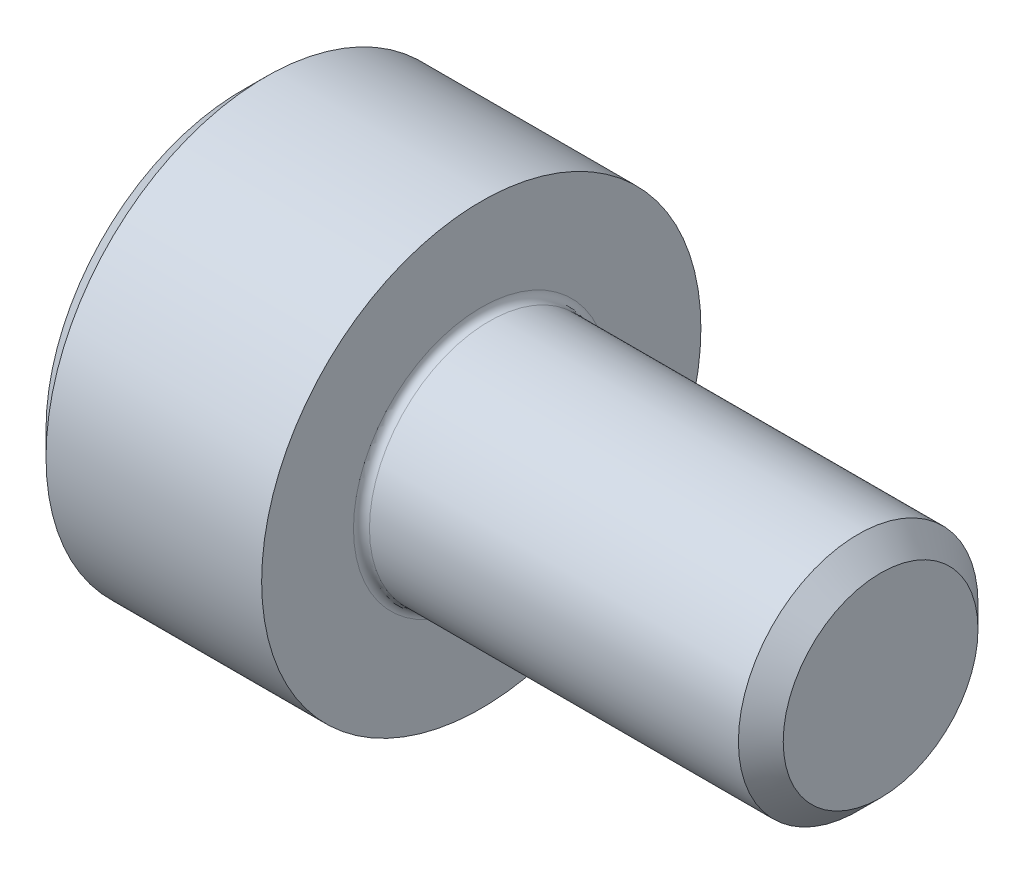
ISO-10303-21;
HEADER;
FILE_DESCRIPTION(('STEP AP214'),'2;1');
FILE_NAME('part.step','',(''),(''),'','','');
FILE_SCHEMA(('AUTOMOTIVE_DESIGN { 1 0 10303 214 1 1 1 1 }'));
ENDSEC;
DATA;
#1=APPLICATION_CONTEXT('core data for automotive mechanical design processes');
#2=APPLICATION_PROTOCOL_DEFINITION('international standard','automotive_design',2000,#1);
#3=PRODUCT_CONTEXT('',#1,'mechanical');
#4=PRODUCT('Part','Part','',(#3));
#5=PRODUCT_RELATED_PRODUCT_CATEGORY('part','',(#4));
#6=PRODUCT_DEFINITION_FORMATION('','',#4);
#7=PRODUCT_DEFINITION_CONTEXT('part definition',#1,'design');
#8=PRODUCT_DEFINITION('design','',#6,#7);
#9=PRODUCT_DEFINITION_SHAPE('','',#8);
#10=(LENGTH_UNIT() NAMED_UNIT(*) SI_UNIT(.MILLI.,.METRE.));
#11=(NAMED_UNIT(*) PLANE_ANGLE_UNIT() SI_UNIT($,.RADIAN.));
#12=(NAMED_UNIT(*) SI_UNIT($,.STERADIAN.) SOLID_ANGLE_UNIT());
#13=UNCERTAINTY_MEASURE_WITH_UNIT(LENGTH_MEASURE(1.E-05),#10,'distance_accuracy_value','');
#14=(GEOMETRIC_REPRESENTATION_CONTEXT(3) GLOBAL_UNCERTAINTY_ASSIGNED_CONTEXT((#13)) GLOBAL_UNIT_ASSIGNED_CONTEXT((#10,
#11,#12)) REPRESENTATION_CONTEXT('',''));
#15=CARTESIAN_POINT('',(0.,0.,0.));
#16=DIRECTION('',(0.,0.,1.));
#17=DIRECTION('',(1.,0.,0.));
#18=AXIS2_PLACEMENT_3D('',#15,#16,#17);
#19=CARTESIAN_POINT('',(0.,0.,0.));
#20=DIRECTION('',(-1.,0.,0.));
#21=DIRECTION('',(0.,0.,1.));
#22=AXIS2_PLACEMENT_3D('',#19,#20,#21);
#23=PLANE('',#22);
#24=DIRECTION('',(0.,-0.499999999999999,0.866025403784439));
#25=VECTOR('',#24,1.);
#26=CARTESIAN_POINT('',(0.,1.47801668912544,0.));
#27=LINE('',#26,#25);
#28=CARTESIAN_POINT('',(0.,1.47801668912544,0.));
#29=VERTEX_POINT('',#28);
#30=CARTESIAN_POINT('',(0.,0.73900834456272,1.28));
#31=VERTEX_POINT('',#30);
#32=EDGE_CURVE('E387',#29,#31,#27,.T.);
#33=ORIENTED_EDGE('',*,*,#32,.T.);
#34=DIRECTION('',(0.,1.,0.));
#35=VECTOR('',#34,1.);
#36=CARTESIAN_POINT('',(0.,-0.739008344562722,1.28));
#37=LINE('',#36,#35);
#38=CARTESIAN_POINT('',(0.,-0.739008344562722,1.28));
#39=VERTEX_POINT('',#38);
#40=EDGE_CURVE('E131',#39,#31,#37,.T.);
#41=ORIENTED_EDGE('',*,*,#40,.F.);
#42=DIRECTION('',(0.,-0.500000000000001,-0.866025403784438));
#43=VECTOR('',#42,1.);
#44=CARTESIAN_POINT('',(0.,-0.739008344562722,1.28));
#45=LINE('',#44,#43);
#46=CARTESIAN_POINT('',(0.,-1.47801668912545,0.));
#47=VERTEX_POINT('',#46);
#48=EDGE_CURVE('E390',#39,#47,#45,.T.);
#49=ORIENTED_EDGE('',*,*,#48,.T.);
#50=DIRECTION('',(0.,0.499999999999999,-0.866025403784439));
#51=VECTOR('',#50,1.);
#52=CARTESIAN_POINT('',(0.,-1.47801668912545,0.));
#53=LINE('',#52,#51);
#54=CARTESIAN_POINT('',(0.,-0.739008344562726,-1.28));
#55=VERTEX_POINT('',#54);
#56=EDGE_CURVE('E393',#47,#55,#53,.T.);
#57=ORIENTED_EDGE('',*,*,#56,.T.);
#58=DIRECTION('',(0.,-1.,0.));
#59=VECTOR('',#58,1.);
#60=CARTESIAN_POINT('',(0.,0.739008344562716,-1.28));
#61=LINE('',#60,#59);
#62=CARTESIAN_POINT('',(0.,0.739008344562716,-1.28));
#63=VERTEX_POINT('',#62);
#64=EDGE_CURVE('E396',#63,#55,#61,.T.);
#65=ORIENTED_EDGE('',*,*,#64,.F.);
#66=DIRECTION('',(0.,-0.500000000000001,-0.866025403784438));
#67=VECTOR('',#66,1.);
#68=CARTESIAN_POINT('',(0.,1.47801668912544,0.));
#69=LINE('',#68,#67);
#70=EDGE_CURVE('E126',#29,#63,#69,.T.);
#71=ORIENTED_EDGE('',*,*,#70,.F.);
#72=EDGE_LOOP('',(#33,#41,#49,#57,#65,#71));
#73=FACE_BOUND('',#72,.T.);
#74=CARTESIAN_POINT('',(0.,0.,0.));
#75=DIRECTION('',(-1.,0.,0.));
#76=DIRECTION('',(0.,0.,1.));
#77=AXIS2_PLACEMENT_3D('',#74,#75,#76);
#78=CIRCLE('',#77,2.45);
#79=CARTESIAN_POINT('',(0.,0.,2.45));
#80=VERTEX_POINT('',#79);
#81=EDGE_CURVE('E142',#80,#80,#78,.T.);
#82=ORIENTED_EDGE('',*,*,#81,.T.);
#83=EDGE_LOOP('',(#82));
#84=FACE_BOUND('',#83,.T.);
#85=ADVANCED_FACE('F35',(#73,#84),#23,.T.);
#86=CARTESIAN_POINT('',(8.,1.2195,0.));
#87=DIRECTION('',(1.,0.,0.));
#88=DIRECTION('',(0.,0.,-1.));
#89=AXIS2_PLACEMENT_3D('',#86,#87,#88);
#90=PLANE('',#89);
#91=CARTESIAN_POINT('',(8.,0.,0.));
#92=DIRECTION('',(-1.,0.,0.));
#93=DIRECTION('',(0.,0.,1.));
#94=AXIS2_PLACEMENT_3D('',#91,#92,#93);
#95=CIRCLE('',#94,1.2195);
#96=CARTESIAN_POINT('',(8.,0.,1.2195));
#97=VERTEX_POINT('',#96);
#98=EDGE_CURVE('E155',#97,#97,#95,.T.);
#99=ORIENTED_EDGE('',*,*,#98,.F.);
#100=EDGE_LOOP('',(#99));
#101=FACE_BOUND('',#100,.T.);
#102=ADVANCED_FACE('F176',(#101),#90,.T.);
#103=CARTESIAN_POINT('',(8.,0.,0.));
#104=DIRECTION('',(-1.,0.,0.));
#105=DIRECTION('',(0.,0.,1.));
#106=AXIS2_PLACEMENT_3D('',#103,#104,#105);
#107=CONICAL_SURFACE('',#106,1.2195,0.785398163397469);
#108=CARTESIAN_POINT('',(7.71950000000001,0.,0.));
#109=DIRECTION('',(-1.,0.,0.));
#110=DIRECTION('',(0.,0.,1.));
#111=AXIS2_PLACEMENT_3D('',#108,#109,#110);
#112=CIRCLE('',#111,1.5);
#113=CARTESIAN_POINT('',(7.71950000000001,0.,1.5));
#114=VERTEX_POINT('',#113);
#115=EDGE_CURVE('E152',#114,#114,#112,.T.);
#116=ORIENTED_EDGE('',*,*,#115,.F.);
#117=EDGE_LOOP('',(#116));
#118=FACE_BOUND('',#117,.T.);
#119=ORIENTED_EDGE('',*,*,#98,.T.);
#120=EDGE_LOOP('',(#119));
#121=FACE_BOUND('',#120,.T.);
#122=ADVANCED_FACE('F182',(#118,#121),#107,.T.);
#123=CARTESIAN_POINT('',(-31.75,0.,0.));
#124=DIRECTION('',(-1.,0.,0.));
#125=DIRECTION('',(0.,0.,1.));
#126=AXIS2_PLACEMENT_3D('',#123,#124,#125);
#127=CYLINDRICAL_SURFACE('',#126,1.5);
#128=CARTESIAN_POINT('',(3.1,0.,0.));
#129=DIRECTION('',(1.,0.,0.));
#130=DIRECTION('',(0.,0.,-1.));
#131=AXIS2_PLACEMENT_3D('',#128,#129,#130);
#132=CIRCLE('',#131,1.5);
#133=CARTESIAN_POINT('',(3.1,0.,-1.5));
#134=VERTEX_POINT('',#133);
#135=EDGE_CURVE('E11',#134,#134,#132,.T.);
#136=ORIENTED_EDGE('',*,*,#135,.T.);
#137=EDGE_LOOP('',(#136));
#138=FACE_BOUND('',#137,.T.);
#139=ORIENTED_EDGE('',*,*,#115,.T.);
#140=EDGE_LOOP('',(#139));
#141=FACE_BOUND('',#140,.T.);
#142=ADVANCED_FACE('F193',(#138,#141),#127,.T.);
#143=CARTESIAN_POINT('',(3.,2.75,0.));
#144=DIRECTION('',(1.,0.,0.));
#145=DIRECTION('',(0.,0.,-1.));
#146=AXIS2_PLACEMENT_3D('',#143,#144,#145);
#147=PLANE('',#146);
#148=CARTESIAN_POINT('',(3.,0.,0.));
#149=DIRECTION('',(1.,0.,0.));
#150=DIRECTION('',(0.,0.,-1.));
#151=AXIS2_PLACEMENT_3D('',#148,#149,#150);
#152=CIRCLE('',#151,1.6);
#153=CARTESIAN_POINT('',(3.,0.,-1.6));
#154=VERTEX_POINT('',#153);
#155=EDGE_CURVE('E43',#154,#154,#152,.F.);
#156=ORIENTED_EDGE('',*,*,#155,.T.);
#157=EDGE_LOOP('',(#156));
#158=FACE_BOUND('',#157,.T.);
#159=CARTESIAN_POINT('',(3.,0.,0.));
#160=DIRECTION('',(-1.,0.,0.));
#161=DIRECTION('',(0.,0.,1.));
#162=AXIS2_PLACEMENT_3D('',#159,#160,#161);
#163=CIRCLE('',#162,2.75);
#164=CARTESIAN_POINT('',(3.,0.,2.75));
#165=VERTEX_POINT('',#164);
#166=EDGE_CURVE('E149',#165,#165,#163,.T.);
#167=ORIENTED_EDGE('',*,*,#166,.F.);
#168=EDGE_LOOP('',(#167));
#169=FACE_BOUND('',#168,.T.);
#170=ADVANCED_FACE('F160',(#158,#169),#147,.T.);
#171=CARTESIAN_POINT('',(-31.75,0.,0.));
#172=DIRECTION('',(-1.,0.,0.));
#173=DIRECTION('',(0.,0.,1.));
#174=AXIS2_PLACEMENT_3D('',#171,#172,#173);
#175=CYLINDRICAL_SURFACE('',#174,2.75);
#176=ORIENTED_EDGE('',*,*,#166,.T.);
#177=EDGE_LOOP('',(#176));
#178=FACE_BOUND('',#177,.T.);
#179=CARTESIAN_POINT('',(0.300000000000002,0.,0.));
#180=DIRECTION('',(-1.,0.,0.));
#181=DIRECTION('',(0.,0.,1.));
#182=AXIS2_PLACEMENT_3D('',#179,#180,#181);
#183=CIRCLE('',#182,2.75);
#184=CARTESIAN_POINT('',(0.300000000000002,0.,2.75));
#185=VERTEX_POINT('',#184);
#186=EDGE_CURVE('E146',#185,#185,#183,.T.);
#187=ORIENTED_EDGE('',*,*,#186,.F.);
#188=EDGE_LOOP('',(#187));
#189=FACE_BOUND('',#188,.T.);
#190=ADVANCED_FACE('F171',(#178,#189),#175,.T.);
#191=CARTESIAN_POINT('',(0.,0.,0.));
#192=DIRECTION('',(1.,0.,0.));
#193=DIRECTION('',(0.,0.,-1.));
#194=AXIS2_PLACEMENT_3D('',#191,#192,#193);
#195=CONICAL_SURFACE('',#194,2.45,0.785398163397448);
#196=ORIENTED_EDGE('',*,*,#186,.T.);
#197=EDGE_LOOP('',(#196));
#198=FACE_BOUND('',#197,.T.);
#199=ORIENTED_EDGE('',*,*,#81,.F.);
#200=EDGE_LOOP('',(#199));
#201=FACE_BOUND('',#200,.T.);
#202=ADVANCED_FACE('F164',(#198,#201),#195,.T.);
#203=CARTESIAN_POINT('',(3.1,0.,0.));
#204=DIRECTION('',(1.,0.,0.));
#205=DIRECTION('',(0.,0.,-1.));
#206=AXIS2_PLACEMENT_3D('',#203,#204,#205);
#207=TOROIDAL_SURFACE('',#206,1.6,0.1);
#208=ORIENTED_EDGE('',*,*,#135,.F.);
#209=EDGE_LOOP('',(#208));
#210=FACE_BOUND('',#209,.T.);
#211=ORIENTED_EDGE('',*,*,#155,.F.);
#212=EDGE_LOOP('',(#211));
#213=FACE_BOUND('',#212,.T.);
#214=ADVANCED_FACE('F37',(#210,#213),#207,.F.);
#215=CARTESIAN_POINT('',(1.3,1.47801668912544,0.));
#216=DIRECTION('',(0.,-0.866025403784439,-0.499999999999999));
#217=DIRECTION('',(0.,0.499999999999999,-0.866025403784439));
#218=AXIS2_PLACEMENT_3D('',#215,#216,#217);
#219=PLANE('',#218);
#220=ORIENTED_EDGE('',*,*,#32,.F.);
#221=DIRECTION('',(-1.,0.,0.));
#222=VECTOR('',#221,1.);
#223=CARTESIAN_POINT('',(1.3,1.47801668912544,0.));
#224=LINE('',#223,#222);
#225=CARTESIAN_POINT('',(1.3,1.47801668912544,0.));
#226=VERTEX_POINT('',#225);
#227=EDGE_CURVE('E377',#226,#29,#224,.T.);
#228=ORIENTED_EDGE('',*,*,#227,.F.);
#229=DIRECTION('',(0.,-0.499999999999999,0.866025403784439));
#230=VECTOR('',#229,1.);
#231=CARTESIAN_POINT('',(1.3,1.47801668912544,0.));
#232=LINE('',#231,#230);
#233=CARTESIAN_POINT('',(1.3,1.10851251684408,0.639999999999997));
#234=VERTEX_POINT('',#233);
#235=EDGE_CURVE('E118',#226,#234,#232,.T.);
#236=ORIENTED_EDGE('',*,*,#235,.T.);
#237=CARTESIAN_POINT('',(1.3,0.73900834456272,1.28));
#238=VERTEX_POINT('',#237);
#239=EDGE_CURVE('E109',#234,#238,#232,.T.);
#240=ORIENTED_EDGE('',*,*,#239,.T.);
#241=DIRECTION('',(-1.,0.,0.));
#242=VECTOR('',#241,1.);
#243=CARTESIAN_POINT('',(1.3,0.73900834456272,1.28));
#244=LINE('',#243,#242);
#245=EDGE_CURVE('E123',#238,#31,#244,.T.);
#246=ORIENTED_EDGE('',*,*,#245,.T.);
#247=EDGE_LOOP('',(#220,#228,#236,#240,#246));
#248=FACE_BOUND('',#247,.T.);
#249=ADVANCED_FACE('F122',(#248),#219,.T.);
#250=CARTESIAN_POINT('',(1.3,-0.739008344562722,1.28));
#251=DIRECTION('',(0.,0.,1.));
#252=DIRECTION('',(0.,-1.,0.));
#253=AXIS2_PLACEMENT_3D('',#250,#251,#252);
#254=PLANE('',#253);
#255=ORIENTED_EDGE('',*,*,#40,.T.);
#256=ORIENTED_EDGE('',*,*,#245,.F.);
#257=DIRECTION('',(0.,1.,0.));
#258=VECTOR('',#257,1.);
#259=CARTESIAN_POINT('',(1.3,-0.739008344562722,1.28));
#260=LINE('',#259,#258);
#261=CARTESIAN_POINT('',(1.3,0.,1.28));
#262=VERTEX_POINT('',#261);
#263=EDGE_CURVE('E106',#262,#238,#260,.T.);
#264=ORIENTED_EDGE('',*,*,#263,.F.);
#265=CARTESIAN_POINT('',(1.3,-0.739008344562722,1.28));
#266=VERTEX_POINT('',#265);
#267=EDGE_CURVE('E117',#266,#262,#260,.T.);
#268=ORIENTED_EDGE('',*,*,#267,.F.);
#269=DIRECTION('',(-1.,0.,0.));
#270=VECTOR('',#269,1.);
#271=CARTESIAN_POINT('',(1.3,-0.739008344562722,1.28));
#272=LINE('',#271,#270);
#273=EDGE_CURVE('E133',#266,#39,#272,.T.);
#274=ORIENTED_EDGE('',*,*,#273,.T.);
#275=EDGE_LOOP('',(#255,#256,#264,#268,#274));
#276=FACE_BOUND('',#275,.T.);
#277=ADVANCED_FACE('F128',(#276),#254,.F.);
#278=CARTESIAN_POINT('',(1.3,-0.739008344562722,1.28));
#279=DIRECTION('',(0.,0.866025403784438,-0.500000000000001));
#280=DIRECTION('',(0.,0.500000000000001,0.866025403784438));
#281=AXIS2_PLACEMENT_3D('',#278,#279,#280);
#282=PLANE('',#281);
#283=ORIENTED_EDGE('',*,*,#48,.F.);
#284=ORIENTED_EDGE('',*,*,#273,.F.);
#285=DIRECTION('',(0.,-0.500000000000001,-0.866025403784438));
#286=VECTOR('',#285,1.);
#287=CARTESIAN_POINT('',(1.3,-0.739008344562722,1.28));
#288=LINE('',#287,#286);
#289=CARTESIAN_POINT('',(1.3,-1.10851251684408,0.640000000000002));
#290=VERTEX_POINT('',#289);
#291=EDGE_CURVE('E416',#266,#290,#288,.T.);
#292=ORIENTED_EDGE('',*,*,#291,.T.);
#293=CARTESIAN_POINT('',(1.3,-1.47801668912545,0.));
#294=VERTEX_POINT('',#293);
#295=EDGE_CURVE('E405',#290,#294,#288,.T.);
#296=ORIENTED_EDGE('',*,*,#295,.T.);
#297=DIRECTION('',(-1.,0.,0.));
#298=VECTOR('',#297,1.);
#299=CARTESIAN_POINT('',(1.3,-1.47801668912545,0.));
#300=LINE('',#299,#298);
#301=EDGE_CURVE('E138',#294,#47,#300,.T.);
#302=ORIENTED_EDGE('',*,*,#301,.T.);
#303=EDGE_LOOP('',(#283,#284,#292,#296,#302));
#304=FACE_BOUND('',#303,.T.);
#305=ADVANCED_FACE('F268',(#304),#282,.T.);
#306=CARTESIAN_POINT('',(1.3,-1.47801668912545,0.));
#307=DIRECTION('',(0.,0.866025403784439,0.499999999999999));
#308=DIRECTION('',(0.,-0.499999999999999,0.866025403784439));
#309=AXIS2_PLACEMENT_3D('',#306,#307,#308);
#310=PLANE('',#309);
#311=ORIENTED_EDGE('',*,*,#56,.F.);
#312=ORIENTED_EDGE('',*,*,#301,.F.);
#313=DIRECTION('',(0.,0.499999999999999,-0.866025403784439));
#314=VECTOR('',#313,1.);
#315=CARTESIAN_POINT('',(1.3,-1.47801668912545,0.));
#316=LINE('',#315,#314);
#317=CARTESIAN_POINT('',(1.3,-1.10851251684409,-0.64));
#318=VERTEX_POINT('',#317);
#319=EDGE_CURVE('E383',#294,#318,#316,.T.);
#320=ORIENTED_EDGE('',*,*,#319,.T.);
#321=CARTESIAN_POINT('',(1.3,-0.739008344562726,-1.28));
#322=VERTEX_POINT('',#321);
#323=EDGE_CURVE('E415',#318,#322,#316,.T.);
#324=ORIENTED_EDGE('',*,*,#323,.T.);
#325=DIRECTION('',(-1.,0.,0.));
#326=VECTOR('',#325,1.);
#327=CARTESIAN_POINT('',(1.3,-0.739008344562726,-1.28));
#328=LINE('',#327,#326);
#329=EDGE_CURVE('E376',#322,#55,#328,.T.);
#330=ORIENTED_EDGE('',*,*,#329,.T.);
#331=EDGE_LOOP('',(#311,#312,#320,#324,#330));
#332=FACE_BOUND('',#331,.T.);
#333=ADVANCED_FACE('F276',(#332),#310,.T.);
#334=CARTESIAN_POINT('',(1.3,0.739008344562716,-1.28));
#335=DIRECTION('',(0.,0.,-1.));
#336=DIRECTION('',(0.,1.,0.));
#337=AXIS2_PLACEMENT_3D('',#334,#335,#336);
#338=PLANE('',#337);
#339=ORIENTED_EDGE('',*,*,#64,.T.);
#340=ORIENTED_EDGE('',*,*,#329,.F.);
#341=DIRECTION('',(0.,-1.,0.));
#342=VECTOR('',#341,1.);
#343=CARTESIAN_POINT('',(1.3,0.739008344562716,-1.28));
#344=LINE('',#343,#342);
#345=CARTESIAN_POINT('',(1.3,0.,-1.28));
#346=VERTEX_POINT('',#345);
#347=EDGE_CURVE('E380',#346,#322,#344,.T.);
#348=ORIENTED_EDGE('',*,*,#347,.F.);
#349=CARTESIAN_POINT('',(1.3,0.739008344562716,-1.28));
#350=VERTEX_POINT('',#349);
#351=EDGE_CURVE('E50',#350,#346,#344,.T.);
#352=ORIENTED_EDGE('',*,*,#351,.F.);
#353=DIRECTION('',(-1.,0.,0.));
#354=VECTOR('',#353,1.);
#355=CARTESIAN_POINT('',(1.3,0.739008344562716,-1.28));
#356=LINE('',#355,#354);
#357=EDGE_CURVE('E373',#350,#63,#356,.T.);
#358=ORIENTED_EDGE('',*,*,#357,.T.);
#359=EDGE_LOOP('',(#339,#340,#348,#352,#358));
#360=FACE_BOUND('',#359,.T.);
#361=ADVANCED_FACE('F285',(#360),#338,.F.);
#362=CARTESIAN_POINT('',(1.3,1.47801668912544,0.));
#363=DIRECTION('',(0.,0.866025403784438,-0.500000000000001));
#364=DIRECTION('',(0.,0.500000000000001,0.866025403784438));
#365=AXIS2_PLACEMENT_3D('',#362,#363,#364);
#366=PLANE('',#365);
#367=ORIENTED_EDGE('',*,*,#70,.T.);
#368=ORIENTED_EDGE('',*,*,#357,.F.);
#369=DIRECTION('',(0.,-0.500000000000001,-0.866025403784438));
#370=VECTOR('',#369,1.);
#371=CARTESIAN_POINT('',(1.3,1.47801668912544,0.));
#372=LINE('',#371,#370);
#373=CARTESIAN_POINT('',(1.3,1.10851251684408,-0.640000000000001));
#374=VERTEX_POINT('',#373);
#375=EDGE_CURVE('E363',#374,#350,#372,.T.);
#376=ORIENTED_EDGE('',*,*,#375,.F.);
#377=EDGE_CURVE('E369',#226,#374,#372,.T.);
#378=ORIENTED_EDGE('',*,*,#377,.F.);
#379=ORIENTED_EDGE('',*,*,#227,.T.);
#380=EDGE_LOOP('',(#367,#368,#376,#378,#379));
#381=FACE_BOUND('',#380,.T.);
#382=ADVANCED_FACE('F294',(#381),#366,.F.);
#383=CARTESIAN_POINT('',(1.3,1.47801668912544,0.));
#384=DIRECTION('',(1.,0.,0.));
#385=DIRECTION('',(0.,0.,-1.));
#386=AXIS2_PLACEMENT_3D('',#383,#384,#385);
#387=PLANE('',#386);
#388=ORIENTED_EDGE('',*,*,#347,.T.);
#389=ORIENTED_EDGE('',*,*,#323,.F.);
#390=CARTESIAN_POINT('',(1.3,0.,0.));
#391=DIRECTION('',(-1.,0.,0.));
#392=DIRECTION('',(0.,0.,1.));
#393=AXIS2_PLACEMENT_3D('',#390,#391,#392);
#394=CIRCLE('',#393,1.28);
#395=EDGE_CURVE('E411',#346,#318,#394,.T.);
#396=ORIENTED_EDGE('',*,*,#395,.F.);
#397=EDGE_LOOP('',(#388,#389,#396));
#398=FACE_BOUND('',#397,.T.);
#399=ADVANCED_FACE('F303',(#398),#387,.F.);
#400=ORIENTED_EDGE('',*,*,#319,.F.);
#401=ORIENTED_EDGE('',*,*,#295,.F.);
#402=EDGE_CURVE('E136',#318,#290,#394,.T.);
#403=ORIENTED_EDGE('',*,*,#402,.F.);
#404=EDGE_LOOP('',(#400,#401,#403));
#405=FACE_BOUND('',#404,.T.);
#406=ADVANCED_FACE('F312',(#405),#387,.F.);
#407=ORIENTED_EDGE('',*,*,#291,.F.);
#408=ORIENTED_EDGE('',*,*,#267,.T.);
#409=EDGE_CURVE('E132',#290,#262,#394,.T.);
#410=ORIENTED_EDGE('',*,*,#409,.F.);
#411=EDGE_LOOP('',(#407,#408,#410));
#412=FACE_BOUND('',#411,.T.);
#413=ADVANCED_FACE('F321',(#412),#387,.F.);
#414=ORIENTED_EDGE('',*,*,#263,.T.);
#415=ORIENTED_EDGE('',*,*,#239,.F.);
#416=EDGE_CURVE('E112',#262,#234,#394,.T.);
#417=ORIENTED_EDGE('',*,*,#416,.F.);
#418=EDGE_LOOP('',(#414,#415,#417));
#419=FACE_BOUND('',#418,.T.);
#420=ADVANCED_FACE('F108',(#419),#387,.F.);
#421=ORIENTED_EDGE('',*,*,#235,.F.);
#422=ORIENTED_EDGE('',*,*,#377,.T.);
#423=EDGE_CURVE('E143',#234,#374,#394,.T.);
#424=ORIENTED_EDGE('',*,*,#423,.F.);
#425=EDGE_LOOP('',(#421,#422,#424));
#426=FACE_BOUND('',#425,.T.);
#427=ADVANCED_FACE('F336',(#426),#387,.F.);
#428=ORIENTED_EDGE('',*,*,#375,.T.);
#429=ORIENTED_EDGE('',*,*,#351,.T.);
#430=EDGE_CURVE('E366',#374,#346,#394,.T.);
#431=ORIENTED_EDGE('',*,*,#430,.F.);
#432=EDGE_LOOP('',(#428,#429,#431));
#433=FACE_BOUND('',#432,.T.);
#434=ADVANCED_FACE('F251',(#433),#387,.F.);
#435=CARTESIAN_POINT('',(1.3,0.,0.));
#436=DIRECTION('',(-1.,0.,0.));
#437=DIRECTION('',(0.,0.,1.));
#438=AXIS2_PLACEMENT_3D('',#435,#436,#437);
#439=CONICAL_SURFACE('',#438,1.28,1.0471975511966);
#440=CARTESIAN_POINT('',(2.03900834456273,0.,0.));
#441=VERTEX_POINT('',#440);
#442=VERTEX_LOOP('',#441);
#443=FACE_BOUND('',#442,.T.);
#444=ORIENTED_EDGE('',*,*,#416,.T.);
#445=ORIENTED_EDGE('',*,*,#423,.T.);
#446=ORIENTED_EDGE('',*,*,#430,.T.);
#447=ORIENTED_EDGE('',*,*,#395,.T.);
#448=ORIENTED_EDGE('',*,*,#402,.T.);
#449=ORIENTED_EDGE('',*,*,#409,.T.);
#450=EDGE_LOOP('',(#444,#445,#446,#447,#448,#449));
#451=FACE_BOUND('',#450,.T.);
#452=ADVANCED_FACE('F186',(#443,#451),#439,.F.);
#453=CLOSED_SHELL('',(#85,#102,#122,#142,#170,#190,#202,#214,#249,#277,#305,#333,#361,#382,#399,
#406,#413,#420,#427,#434,#452));
#454=MANIFOLD_SOLID_BREP('B2',#453);
#455=ADVANCED_BREP_SHAPE_REPRESENTATION('',(#18,#454),#14);
#456=SHAPE_DEFINITION_REPRESENTATION(#9,#455);
ENDSEC;
END-ISO-10303-21;
